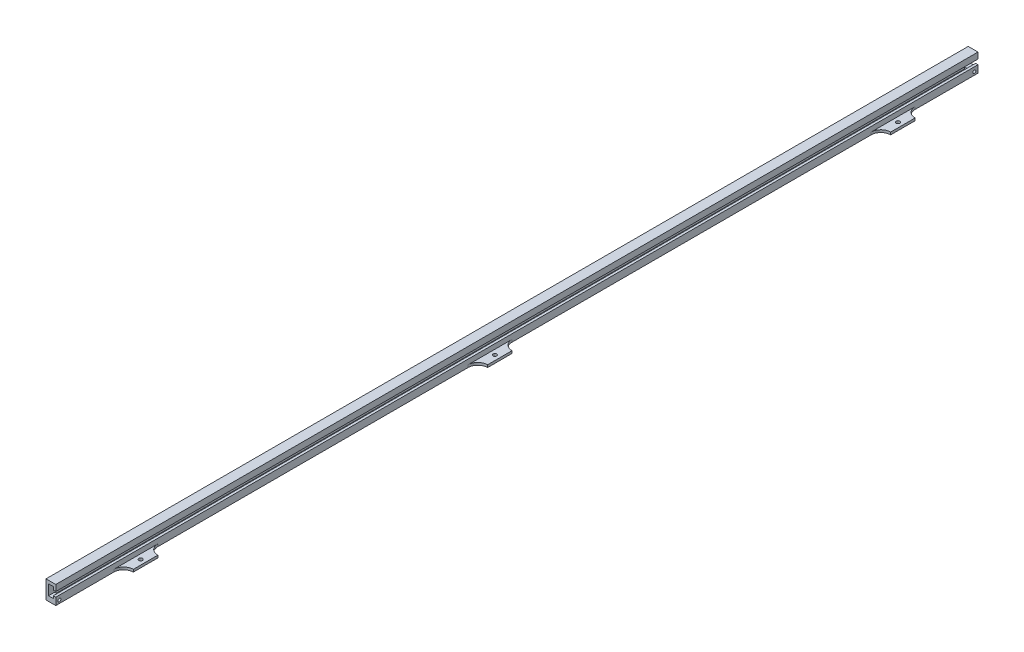
ISO-10303-21;
HEADER;
FILE_DESCRIPTION(('STEP AP214'),'2;1');
FILE_NAME('part.step','',(''),(''),'','','');
FILE_SCHEMA(('AUTOMOTIVE_DESIGN { 1 0 10303 214 1 1 1 1 }'));
ENDSEC;
DATA;
#1=APPLICATION_CONTEXT('core data for automotive mechanical design processes');
#2=APPLICATION_PROTOCOL_DEFINITION('international standard','automotive_design',2000,#1);
#3=PRODUCT_CONTEXT('',#1,'mechanical');
#4=PRODUCT('Part','Part','',(#3));
#5=PRODUCT_RELATED_PRODUCT_CATEGORY('part','',(#4));
#6=PRODUCT_DEFINITION_FORMATION('','',#4);
#7=PRODUCT_DEFINITION_CONTEXT('part definition',#1,'design');
#8=PRODUCT_DEFINITION('design','',#6,#7);
#9=PRODUCT_DEFINITION_SHAPE('','',#8);
#10=(LENGTH_UNIT() NAMED_UNIT(*) SI_UNIT(.MILLI.,.METRE.));
#11=(NAMED_UNIT(*) PLANE_ANGLE_UNIT() SI_UNIT($,.RADIAN.));
#12=(NAMED_UNIT(*) SI_UNIT($,.STERADIAN.) SOLID_ANGLE_UNIT());
#13=UNCERTAINTY_MEASURE_WITH_UNIT(LENGTH_MEASURE(1.E-05),#10,'distance_accuracy_value','');
#14=(GEOMETRIC_REPRESENTATION_CONTEXT(3) GLOBAL_UNCERTAINTY_ASSIGNED_CONTEXT((#13)) GLOBAL_UNIT_ASSIGNED_CONTEXT((#10,
#11,#12)) REPRESENTATION_CONTEXT('',''));
#15=CARTESIAN_POINT('',(0.,0.,0.));
#16=DIRECTION('',(0.,0.,1.));
#17=DIRECTION('',(1.,0.,0.));
#18=AXIS2_PLACEMENT_3D('',#15,#16,#17);
#19=CARTESIAN_POINT('',(8.29532043965097,2.24043168257957,755.));
#20=DIRECTION('',(-1.,0.,0.));
#21=DIRECTION('',(0.,0.,1.));
#22=AXIS2_PLACEMENT_3D('',#19,#20,#21);
#23=PLANE('',#22);
#24=CARTESIAN_POINT('',(8.29532043965097,4.74043168257957,752.));
#25=DIRECTION('',(1.,0.,0.));
#26=DIRECTION('',(0.,0.,-1.));
#27=AXIS2_PLACEMENT_3D('',#24,#25,#26);
#28=CIRCLE('',#27,1.24999999999999);
#29=CARTESIAN_POINT('',(8.29532043965097,4.74043168257957,750.75));
#30=VERTEX_POINT('',#29);
#31=EDGE_CURVE('E533',#30,#30,#28,.T.);
#32=ORIENTED_EDGE('',*,*,#31,.F.);
#33=EDGE_LOOP('',(#32));
#34=FACE_BOUND('',#33,.T.);
#35=DIRECTION('',(0.,0.,-1.));
#36=VECTOR('',#35,1.);
#37=CARTESIAN_POINT('',(8.29532043965097,2.24043168257957,755.));
#38=LINE('',#37,#36);
#39=CARTESIAN_POINT('',(8.29532043965097,2.24043168257957,381.500000045339));
#40=VERTEX_POINT('',#39);
#41=CARTESIAN_POINT('',(8.29532043965097,2.24043168257957,87.5000000453386));
#42=VERTEX_POINT('',#41);
#43=EDGE_CURVE('E464',#40,#42,#38,.T.);
#44=ORIENTED_EDGE('',*,*,#43,.T.);
#45=DIRECTION('',(0.,-1.,0.));
#46=VECTOR('',#45,1.);
#47=CARTESIAN_POINT('',(8.29532043965097,2.24043168257957,87.5000000453386));
#48=LINE('',#47,#46);
#49=CARTESIAN_POINT('',(8.29532043965102,4.24043168257956,87.5000000453386));
#50=VERTEX_POINT('',#49);
#51=EDGE_CURVE('E413',#42,#50,#48,.F.);
#52=ORIENTED_EDGE('',*,*,#51,.T.);
#53=DIRECTION('',(0.,0.,-1.));
#54=VECTOR('',#53,1.);
#55=CARTESIAN_POINT('',(8.29532043965102,4.24043168257956,59.5000000453383));
#56=LINE('',#55,#54);
#57=CARTESIAN_POINT('',(8.29532043965102,4.24043168257956,51.5000000453384));
#58=VERTEX_POINT('',#57);
#59=EDGE_CURVE('E281',#50,#58,#56,.T.);
#60=ORIENTED_EDGE('',*,*,#59,.T.);
#61=DIRECTION('',(0.,-1.,0.));
#62=VECTOR('',#61,1.);
#63=CARTESIAN_POINT('',(8.29532043965097,2.24043168257957,51.5000000453384));
#64=LINE('',#63,#62);
#65=CARTESIAN_POINT('',(8.29532043965097,2.24043168257957,51.5000000453384));
#66=VERTEX_POINT('',#65);
#67=EDGE_CURVE('E410',#58,#66,#64,.T.);
#68=ORIENTED_EDGE('',*,*,#67,.T.);
#69=CARTESIAN_POINT('',(8.29532043965097,2.24043168257957,0.));
#70=VERTEX_POINT('',#69);
#71=EDGE_CURVE('E390',#66,#70,#38,.T.);
#72=ORIENTED_EDGE('',*,*,#71,.T.);
#73=DIRECTION('',(0.,1.,0.));
#74=VECTOR('',#73,1.);
#75=CARTESIAN_POINT('',(8.29532043965097,2.24043168257957,0.));
#76=LINE('',#75,#74);
#77=CARTESIAN_POINT('',(8.29532043965097,8.24043168257957,0.));
#78=VERTEX_POINT('',#77);
#79=EDGE_CURVE('E345',#70,#78,#76,.T.);
#80=ORIENTED_EDGE('',*,*,#79,.T.);
#81=DIRECTION('',(0.,0.,-1.));
#82=VECTOR('',#81,1.);
#83=CARTESIAN_POINT('',(8.29532043965097,8.24043168257957,755.));
#84=LINE('',#83,#82);
#85=CARTESIAN_POINT('',(8.29532043965097,8.24043168257957,755.));
#86=VERTEX_POINT('',#85);
#87=EDGE_CURVE('E387',#86,#78,#84,.T.);
#88=ORIENTED_EDGE('',*,*,#87,.F.);
#89=DIRECTION('',(0.,1.,0.));
#90=VECTOR('',#89,1.);
#91=CARTESIAN_POINT('',(8.29532043965097,2.24043168257957,755.));
#92=LINE('',#91,#90);
#93=CARTESIAN_POINT('',(8.29532043965097,2.24043168257957,755.));
#94=VERTEX_POINT('',#93);
#95=EDGE_CURVE('E321',#94,#86,#92,.T.);
#96=ORIENTED_EDGE('',*,*,#95,.F.);
#97=CARTESIAN_POINT('',(8.29532043965097,2.24043168257957,707.500000045338));
#98=VERTEX_POINT('',#97);
#99=EDGE_CURVE('E391',#94,#98,#38,.T.);
#100=ORIENTED_EDGE('',*,*,#99,.T.);
#101=DIRECTION('',(0.,-1.,0.));
#102=VECTOR('',#101,1.);
#103=CARTESIAN_POINT('',(8.29532043965097,2.24043168257957,707.500000045338));
#104=LINE('',#103,#102);
#105=CARTESIAN_POINT('',(8.29532043965097,4.24043168257956,707.500000045338));
#106=VERTEX_POINT('',#105);
#107=EDGE_CURVE('E398',#98,#106,#104,.F.);
#108=ORIENTED_EDGE('',*,*,#107,.T.);
#109=DIRECTION('',(0.,0.,-1.));
#110=VECTOR('',#109,1.);
#111=CARTESIAN_POINT('',(8.29532043965097,4.24043168257956,679.500000045338));
#112=LINE('',#111,#110);
#113=CARTESIAN_POINT('',(8.29532043965097,4.24043168257956,671.500000045338));
#114=VERTEX_POINT('',#113);
#115=EDGE_CURVE('E261',#106,#114,#112,.T.);
#116=ORIENTED_EDGE('',*,*,#115,.T.);
#117=DIRECTION('',(0.,-1.,0.));
#118=VECTOR('',#117,1.);
#119=CARTESIAN_POINT('',(8.29532043965097,2.24043168257957,671.500000045338));
#120=LINE('',#119,#118);
#121=CARTESIAN_POINT('',(8.29532043965097,2.24043168257957,671.500000045338));
#122=VERTEX_POINT('',#121);
#123=EDGE_CURVE('E401',#114,#122,#120,.T.);
#124=ORIENTED_EDGE('',*,*,#123,.T.);
#125=CARTESIAN_POINT('',(8.29532043965097,2.24043168257957,417.500000045339));
#126=VERTEX_POINT('',#125);
#127=EDGE_CURVE('E395',#122,#126,#38,.T.);
#128=ORIENTED_EDGE('',*,*,#127,.T.);
#129=DIRECTION('',(0.,-1.,0.));
#130=VECTOR('',#129,1.);
#131=CARTESIAN_POINT('',(8.29532043965097,2.24043168257957,417.500000045339));
#132=LINE('',#131,#130);
#133=CARTESIAN_POINT('',(8.29532043965097,4.24043168257956,417.500000045339));
#134=VERTEX_POINT('',#133);
#135=EDGE_CURVE('E404',#126,#134,#132,.F.);
#136=ORIENTED_EDGE('',*,*,#135,.T.);
#137=DIRECTION('',(0.,0.,-1.));
#138=VECTOR('',#137,1.);
#139=CARTESIAN_POINT('',(8.29532043965097,4.24043168257956,389.500000045339));
#140=LINE('',#139,#138);
#141=CARTESIAN_POINT('',(8.29532043965097,4.24043168257956,381.500000045339));
#142=VERTEX_POINT('',#141);
#143=EDGE_CURVE('E301',#134,#142,#140,.T.);
#144=ORIENTED_EDGE('',*,*,#143,.T.);
#145=DIRECTION('',(0.,-1.,0.));
#146=VECTOR('',#145,1.);
#147=CARTESIAN_POINT('',(8.29532043965097,2.24043168257957,381.500000045339));
#148=LINE('',#147,#146);
#149=EDGE_CURVE('E407',#142,#40,#148,.T.);
#150=ORIENTED_EDGE('',*,*,#149,.T.);
#151=EDGE_LOOP('',(#44,#52,#60,#68,#72,#80,#88,#96,#100,#108,#116,#124,#128,#136,#144,#150));
#152=FACE_BOUND('',#151,.T.);
#153=CARTESIAN_POINT('',(8.29532043965097,4.74043168257957,3.));
#154=DIRECTION('',(1.,0.,0.));
#155=DIRECTION('',(0.,0.,-1.));
#156=AXIS2_PLACEMENT_3D('',#153,#154,#155);
#157=CIRCLE('',#156,1.24999999999999);
#158=CARTESIAN_POINT('',(8.29532043965097,4.74043168257957,1.75000000000002));
#159=VERTEX_POINT('',#158);
#160=EDGE_CURVE('E526',#159,#159,#157,.T.);
#161=ORIENTED_EDGE('',*,*,#160,.F.);
#162=EDGE_LOOP('',(#161));
#163=FACE_BOUND('',#162,.T.);
#164=ADVANCED_FACE('F39',(#34,#152,#163),#23,.F.);
#165=CARTESIAN_POINT('',(6.29532043965097,4.74043168257957,755.));
#166=DIRECTION('',(0.,-1.,0.));
#167=DIRECTION('',(1.,0.,0.));
#168=AXIS2_PLACEMENT_3D('',#165,#166,#167);
#169=PLANE('',#168);
#170=DIRECTION('',(-1.,0.,0.));
#171=VECTOR('',#170,1.);
#172=CARTESIAN_POINT('',(0.,4.74043168257956,5.));
#173=LINE('',#172,#171);
#174=CARTESIAN_POINT('',(6.29532043965097,4.74043168257957,5.));
#175=VERTEX_POINT('',#174);
#176=CARTESIAN_POINT('',(2.29532043965097,4.74043168257957,5.));
#177=VERTEX_POINT('',#176);
#178=EDGE_CURVE('E523',#175,#177,#173,.T.);
#179=ORIENTED_EDGE('',*,*,#178,.T.);
#180=DIRECTION('',(0.,0.,-1.));
#181=VECTOR('',#180,1.);
#182=CARTESIAN_POINT('',(2.29532043965097,4.74043168257957,755.));
#183=LINE('',#182,#181);
#184=CARTESIAN_POINT('',(2.29532043965097,4.74043168257957,750.));
#185=VERTEX_POINT('',#184);
#186=EDGE_CURVE('E380',#185,#177,#183,.T.);
#187=ORIENTED_EDGE('',*,*,#186,.F.);
#188=DIRECTION('',(-1.,0.,0.));
#189=VECTOR('',#188,1.);
#190=CARTESIAN_POINT('',(0.,4.74043168257956,750.));
#191=LINE('',#190,#189);
#192=CARTESIAN_POINT('',(6.29532043965097,4.74043168257957,750.));
#193=VERTEX_POINT('',#192);
#194=EDGE_CURVE('E234',#193,#185,#191,.T.);
#195=ORIENTED_EDGE('',*,*,#194,.F.);
#196=DIRECTION('',(0.,0.,-1.));
#197=VECTOR('',#196,1.);
#198=CARTESIAN_POINT('',(6.29532043965097,4.74043168257957,755.));
#199=LINE('',#198,#197);
#200=EDGE_CURVE('E244',#193,#175,#199,.T.);
#201=ORIENTED_EDGE('',*,*,#200,.T.);
#202=EDGE_LOOP('',(#179,#187,#195,#201));
#203=FACE_BOUND('',#202,.T.);
#204=ADVANCED_FACE('F552',(#203),#169,.F.);
#205=CARTESIAN_POINT('',(6.29532043965097,8.24043168257957,755.));
#206=DIRECTION('',(1.,0.,0.));
#207=DIRECTION('',(0.,0.,-1.));
#208=AXIS2_PLACEMENT_3D('',#205,#206,#207);
#209=PLANE('',#208);
#210=DIRECTION('',(0.,0.,-1.));
#211=VECTOR('',#210,1.);
#212=CARTESIAN_POINT('',(6.29532043965097,6.24043168257957,5.));
#213=LINE('',#212,#211);
#214=CARTESIAN_POINT('',(6.29532043965097,6.24043168257957,5.));
#215=VERTEX_POINT('',#214);
#216=CARTESIAN_POINT('',(6.29532043965097,6.24043168257957,0.));
#217=VERTEX_POINT('',#216);
#218=EDGE_CURVE('E54',#215,#217,#213,.T.);
#219=ORIENTED_EDGE('',*,*,#218,.F.);
#220=DIRECTION('',(0.,-1.,0.));
#221=VECTOR('',#220,1.);
#222=CARTESIAN_POINT('',(6.29532043965097,0.,5.));
#223=LINE('',#222,#221);
#224=EDGE_CURVE('E59',#215,#175,#223,.T.);
#225=ORIENTED_EDGE('',*,*,#224,.T.);
#226=ORIENTED_EDGE('',*,*,#200,.F.);
#227=DIRECTION('',(0.,-1.,0.));
#228=VECTOR('',#227,1.);
#229=CARTESIAN_POINT('',(6.29532043965097,0.,750.));
#230=LINE('',#229,#228);
#231=CARTESIAN_POINT('',(6.29532043965097,6.24043168257957,750.));
#232=VERTEX_POINT('',#231);
#233=EDGE_CURVE('E238',#232,#193,#230,.T.);
#234=ORIENTED_EDGE('',*,*,#233,.F.);
#235=DIRECTION('',(0.,0.,1.));
#236=VECTOR('',#235,1.);
#237=CARTESIAN_POINT('',(6.29532043965097,6.24043168257957,750.));
#238=LINE('',#237,#236);
#239=CARTESIAN_POINT('',(6.29532043965097,6.24043168257957,755.));
#240=VERTEX_POINT('',#239);
#241=EDGE_CURVE('E223',#232,#240,#238,.T.);
#242=ORIENTED_EDGE('',*,*,#241,.T.);
#243=DIRECTION('',(0.,-1.,0.));
#244=VECTOR('',#243,1.);
#245=CARTESIAN_POINT('',(6.29532043965097,8.24043168257957,755.));
#246=LINE('',#245,#244);
#247=CARTESIAN_POINT('',(6.29532043965097,8.24043168257957,755.));
#248=VERTEX_POINT('',#247);
#249=EDGE_CURVE('E325',#248,#240,#246,.T.);
#250=ORIENTED_EDGE('',*,*,#249,.F.);
#251=DIRECTION('',(0.,0.,-1.));
#252=VECTOR('',#251,1.);
#253=CARTESIAN_POINT('',(6.29532043965097,8.24043168257957,755.));
#254=LINE('',#253,#252);
#255=CARTESIAN_POINT('',(6.29532043965097,8.24043168257957,0.));
#256=VERTEX_POINT('',#255);
#257=EDGE_CURVE('E384',#248,#256,#254,.T.);
#258=ORIENTED_EDGE('',*,*,#257,.T.);
#259=DIRECTION('',(0.,-1.,0.));
#260=VECTOR('',#259,1.);
#261=CARTESIAN_POINT('',(6.29532043965097,8.24043168257957,0.));
#262=LINE('',#261,#260);
#263=EDGE_CURVE('E349',#256,#217,#262,.T.);
#264=ORIENTED_EDGE('',*,*,#263,.T.);
#265=EDGE_LOOP('',(#219,#225,#226,#234,#242,#250,#258,#264));
#266=FACE_BOUND('',#265,.T.);
#267=ADVANCED_FACE('F243',(#266),#209,.F.);
#268=CARTESIAN_POINT('',(2.29532043965097,14.7404316825796,755.));
#269=DIRECTION('',(-1.,0.,0.));
#270=DIRECTION('',(0.,0.,1.));
#271=AXIS2_PLACEMENT_3D('',#268,#269,#270);
#272=PLANE('',#271);
#273=DIRECTION('',(0.,0.,-1.));
#274=VECTOR('',#273,1.);
#275=CARTESIAN_POINT('',(2.29532043965097,6.24043168257957,5.));
#276=LINE('',#275,#274);
#277=CARTESIAN_POINT('',(2.29532043965097,6.24043168257957,5.));
#278=VERTEX_POINT('',#277);
#279=CARTESIAN_POINT('',(2.29532043965097,6.24043168257957,0.));
#280=VERTEX_POINT('',#279);
#281=EDGE_CURVE('E516',#278,#280,#276,.T.);
#282=ORIENTED_EDGE('',*,*,#281,.T.);
#283=DIRECTION('',(0.,1.,0.));
#284=VECTOR('',#283,1.);
#285=CARTESIAN_POINT('',(2.29532043965097,14.7404316825796,0.));
#286=LINE('',#285,#284);
#287=CARTESIAN_POINT('',(2.29532043965097,14.7404316825796,0.));
#288=VERTEX_POINT('',#287);
#289=EDGE_CURVE('E351',#280,#288,#286,.T.);
#290=ORIENTED_EDGE('',*,*,#289,.T.);
#291=DIRECTION('',(0.,0.,-1.));
#292=VECTOR('',#291,1.);
#293=CARTESIAN_POINT('',(2.29532043965097,14.7404316825796,755.));
#294=LINE('',#293,#292);
#295=CARTESIAN_POINT('',(2.29532043965097,14.7404316825796,755.));
#296=VERTEX_POINT('',#295);
#297=EDGE_CURVE('E377',#296,#288,#294,.T.);
#298=ORIENTED_EDGE('',*,*,#297,.F.);
#299=DIRECTION('',(0.,1.,0.));
#300=VECTOR('',#299,1.);
#301=CARTESIAN_POINT('',(2.29532043965097,14.7404316825796,755.));
#302=LINE('',#301,#300);
#303=CARTESIAN_POINT('',(2.29532043965097,6.24043168257957,755.));
#304=VERTEX_POINT('',#303);
#305=EDGE_CURVE('E327',#304,#296,#302,.T.);
#306=ORIENTED_EDGE('',*,*,#305,.F.);
#307=DIRECTION('',(0.,0.,1.));
#308=VECTOR('',#307,1.);
#309=CARTESIAN_POINT('',(2.29532043965097,6.24043168257957,750.));
#310=LINE('',#309,#308);
#311=CARTESIAN_POINT('',(2.29532043965097,6.24043168257957,750.));
#312=VERTEX_POINT('',#311);
#313=EDGE_CURVE('E233',#312,#304,#310,.T.);
#314=ORIENTED_EDGE('',*,*,#313,.F.);
#315=DIRECTION('',(0.,1.,0.));
#316=VECTOR('',#315,1.);
#317=CARTESIAN_POINT('',(2.29532043965097,0.,750.));
#318=LINE('',#317,#316);
#319=EDGE_CURVE('E241',#185,#312,#318,.T.);
#320=ORIENTED_EDGE('',*,*,#319,.F.);
#321=ORIENTED_EDGE('',*,*,#186,.T.);
#322=DIRECTION('',(0.,1.,0.));
#323=VECTOR('',#322,1.);
#324=CARTESIAN_POINT('',(2.29532043965097,0.,5.));
#325=LINE('',#324,#323);
#326=EDGE_CURVE('E827',#177,#278,#325,.T.);
#327=ORIENTED_EDGE('',*,*,#326,.T.);
#328=EDGE_LOOP('',(#282,#290,#298,#306,#314,#320,#321,#327));
#329=FACE_BOUND('',#328,.T.);
#330=ADVANCED_FACE('F514',(#329),#272,.F.);
#331=CARTESIAN_POINT('',(0.295320439650968,2.24043168257957,755.));
#332=DIRECTION('',(1.,0.,0.));
#333=DIRECTION('',(0.,0.,-1.));
#334=AXIS2_PLACEMENT_3D('',#331,#332,#333);
#335=PLANE('',#334);
#336=CARTESIAN_POINT('',(0.295320439650961,4.74043168257957,3.));
#337=DIRECTION('',(1.,0.,0.));
#338=DIRECTION('',(0.,0.,-1.));
#339=AXIS2_PLACEMENT_3D('',#336,#337,#338);
#340=CIRCLE('',#339,1.24999999999999);
#341=CARTESIAN_POINT('',(0.295320439650961,4.74043168257957,1.75000000000002));
#342=VERTEX_POINT('',#341);
#343=EDGE_CURVE('E521',#342,#342,#340,.T.);
#344=ORIENTED_EDGE('',*,*,#343,.T.);
#345=EDGE_LOOP('',(#344));
#346=FACE_BOUND('',#345,.T.);
#347=CARTESIAN_POINT('',(0.295320439650961,4.74043168257957,752.));
#348=DIRECTION('',(1.,0.,0.));
#349=DIRECTION('',(0.,0.,-1.));
#350=AXIS2_PLACEMENT_3D('',#347,#348,#349);
#351=CIRCLE('',#350,1.24999999999999);
#352=CARTESIAN_POINT('',(0.295320439650961,4.74043168257957,750.75));
#353=VERTEX_POINT('',#352);
#354=EDGE_CURVE('E246',#353,#353,#351,.T.);
#355=ORIENTED_EDGE('',*,*,#354,.T.);
#356=EDGE_LOOP('',(#355));
#357=FACE_BOUND('',#356,.T.);
#358=DIRECTION('',(0.,-1.,0.));
#359=VECTOR('',#358,1.);
#360=CARTESIAN_POINT('',(0.295320439650968,2.24043168257957,0.));
#361=LINE('',#360,#359);
#362=CARTESIAN_POINT('',(0.295320439650968,17.2404316825796,0.));
#363=VERTEX_POINT('',#362);
#364=CARTESIAN_POINT('',(0.295320439650968,2.24043168257957,0.));
#365=VERTEX_POINT('',#364);
#366=EDGE_CURVE('E312',#363,#365,#361,.T.);
#367=ORIENTED_EDGE('',*,*,#366,.T.);
#368=DIRECTION('',(0.,0.,-1.));
#369=VECTOR('',#368,1.);
#370=CARTESIAN_POINT('',(0.295320439650968,2.24043168257957,755.));
#371=LINE('',#370,#369);
#372=CARTESIAN_POINT('',(0.295320439650968,2.24043168257957,755.));
#373=VERTEX_POINT('',#372);
#374=EDGE_CURVE('E394',#373,#365,#371,.T.);
#375=ORIENTED_EDGE('',*,*,#374,.F.);
#376=DIRECTION('',(0.,-1.,0.));
#377=VECTOR('',#376,1.);
#378=CARTESIAN_POINT('',(0.295320439650968,2.24043168257957,755.));
#379=LINE('',#378,#377);
#380=CARTESIAN_POINT('',(0.295320439650968,17.2404316825796,755.));
#381=VERTEX_POINT('',#380);
#382=EDGE_CURVE('E315',#381,#373,#379,.T.);
#383=ORIENTED_EDGE('',*,*,#382,.F.);
#384=DIRECTION('',(0.,0.,-1.));
#385=VECTOR('',#384,1.);
#386=CARTESIAN_POINT('',(0.295320439650968,17.2404316825796,755.));
#387=LINE('',#386,#385);
#388=EDGE_CURVE('E339',#381,#363,#387,.T.);
#389=ORIENTED_EDGE('',*,*,#388,.T.);
#390=EDGE_LOOP('',(#367,#375,#383,#389));
#391=FACE_BOUND('',#390,.T.);
#392=ADVANCED_FACE('F488',(#346,#357,#391),#335,.F.);
#393=CARTESIAN_POINT('',(0.295320439650968,2.24043168257957,755.));
#394=DIRECTION('',(0.,1.,0.));
#395=DIRECTION('',(0.,0.,1.));
#396=AXIS2_PLACEMENT_3D('',#393,#394,#395);
#397=PLANE('',#396);
#398=DIRECTION('',(1.,0.,0.));
#399=VECTOR('',#398,1.);
#400=CARTESIAN_POINT('',(0.295320439650968,2.24043168257957,0.));
#401=LINE('',#400,#399);
#402=EDGE_CURVE('E342',#365,#70,#401,.T.);
#403=ORIENTED_EDGE('',*,*,#402,.T.);
#404=ORIENTED_EDGE('',*,*,#71,.F.);
#405=CARTESIAN_POINT('',(16.295320439651,2.24043168257957,51.5000000453384));
#406=DIRECTION('',(0.,1.,0.));
#407=DIRECTION('',(0.,0.,1.));
#408=AXIS2_PLACEMENT_3D('',#405,#406,#407);
#409=CIRCLE('',#408,8.);
#410=CARTESIAN_POINT('',(16.295320439651,2.24043168257957,59.5000000453383));
#411=VERTEX_POINT('',#410);
#412=EDGE_CURVE('E420',#66,#411,#409,.T.);
#413=ORIENTED_EDGE('',*,*,#412,.T.);
#414=DIRECTION('',(0.,0.,1.));
#415=VECTOR('',#414,1.);
#416=CARTESIAN_POINT('',(16.295320439651,2.24043168257957,79.5000000453386));
#417=LINE('',#416,#415);
#418=CARTESIAN_POINT('',(16.295320439651,2.24043168257957,79.5000000453386));
#419=VERTEX_POINT('',#418);
#420=EDGE_CURVE('E278',#411,#419,#417,.T.);
#421=ORIENTED_EDGE('',*,*,#420,.T.);
#422=CARTESIAN_POINT('',(16.295320439651,2.24043168257957,87.5000000453386));
#423=DIRECTION('',(0.,1.,0.));
#424=DIRECTION('',(0.,0.,1.));
#425=AXIS2_PLACEMENT_3D('',#422,#423,#424);
#426=CIRCLE('',#425,8.);
#427=EDGE_CURVE('E416',#419,#42,#426,.T.);
#428=ORIENTED_EDGE('',*,*,#427,.T.);
#429=ORIENTED_EDGE('',*,*,#43,.F.);
#430=CARTESIAN_POINT('',(16.295320439651,2.24043168257957,381.500000045339));
#431=DIRECTION('',(0.,1.,0.));
#432=DIRECTION('',(0.,0.,1.));
#433=AXIS2_PLACEMENT_3D('',#430,#431,#432);
#434=CIRCLE('',#433,8.);
#435=CARTESIAN_POINT('',(16.295320439651,2.24043168257957,389.500000045339));
#436=VERTEX_POINT('',#435);
#437=EDGE_CURVE('E425',#40,#436,#434,.T.);
#438=ORIENTED_EDGE('',*,*,#437,.T.);
#439=DIRECTION('',(0.,0.,1.));
#440=VECTOR('',#439,1.);
#441=CARTESIAN_POINT('',(16.295320439651,2.24043168257957,409.500000045339));
#442=LINE('',#441,#440);
#443=CARTESIAN_POINT('',(16.295320439651,2.24043168257957,409.500000045339));
#444=VERTEX_POINT('',#443);
#445=EDGE_CURVE('E298',#436,#444,#442,.T.);
#446=ORIENTED_EDGE('',*,*,#445,.T.);
#447=CARTESIAN_POINT('',(16.295320439651,2.24043168257957,417.500000045339));
#448=DIRECTION('',(0.,1.,0.));
#449=DIRECTION('',(0.,0.,1.));
#450=AXIS2_PLACEMENT_3D('',#447,#448,#449);
#451=CIRCLE('',#450,8.);
#452=EDGE_CURVE('E430',#444,#126,#451,.T.);
#453=ORIENTED_EDGE('',*,*,#452,.T.);
#454=ORIENTED_EDGE('',*,*,#127,.F.);
#455=CARTESIAN_POINT('',(16.295320439651,2.24043168257957,671.500000045338));
#456=DIRECTION('',(0.,1.,0.));
#457=DIRECTION('',(0.,0.,1.));
#458=AXIS2_PLACEMENT_3D('',#455,#456,#457);
#459=CIRCLE('',#458,8.);
#460=CARTESIAN_POINT('',(16.295320439651,2.24043168257957,679.500000045338));
#461=VERTEX_POINT('',#460);
#462=EDGE_CURVE('E434',#122,#461,#459,.T.);
#463=ORIENTED_EDGE('',*,*,#462,.T.);
#464=DIRECTION('',(0.,0.,1.));
#465=VECTOR('',#464,1.);
#466=CARTESIAN_POINT('',(16.295320439651,2.24043168257957,699.500000045338));
#467=LINE('',#466,#465);
#468=CARTESIAN_POINT('',(16.295320439651,2.24043168257957,699.500000045338));
#469=VERTEX_POINT('',#468);
#470=EDGE_CURVE('E258',#461,#469,#467,.T.);
#471=ORIENTED_EDGE('',*,*,#470,.T.);
#472=CARTESIAN_POINT('',(16.295320439651,2.24043168257957,707.500000045338));
#473=DIRECTION('',(0.,1.,0.));
#474=DIRECTION('',(0.,0.,1.));
#475=AXIS2_PLACEMENT_3D('',#472,#473,#474);
#476=CIRCLE('',#475,8.);
#477=EDGE_CURVE('E47',#469,#98,#476,.T.);
#478=ORIENTED_EDGE('',*,*,#477,.T.);
#479=ORIENTED_EDGE('',*,*,#99,.F.);
#480=DIRECTION('',(1.,0.,0.));
#481=VECTOR('',#480,1.);
#482=CARTESIAN_POINT('',(0.295320439650968,2.24043168257957,755.));
#483=LINE('',#482,#481);
#484=EDGE_CURVE('E318',#373,#94,#483,.T.);
#485=ORIENTED_EDGE('',*,*,#484,.F.);
#486=ORIENTED_EDGE('',*,*,#374,.T.);
#487=EDGE_LOOP('',(#403,#404,#413,#421,#428,#429,#438,#446,#453,#454,#463,#471,#478,#479,#485,#486));
#488=FACE_BOUND('',#487,.T.);
#489=CARTESIAN_POINT('',(12.295320439651,2.24043168257957,399.500000045339));
#490=DIRECTION('',(0.,-1.,0.));
#491=DIRECTION('',(0.,0.,-1.));
#492=AXIS2_PLACEMENT_3D('',#489,#490,#491);
#493=CIRCLE('',#492,1.5);
#494=CARTESIAN_POINT('',(12.295320439651,2.24043168257957,398.000000045339));
#495=VERTEX_POINT('',#494);
#496=EDGE_CURVE('E292',#495,#495,#493,.T.);
#497=ORIENTED_EDGE('',*,*,#496,.F.);
#498=EDGE_LOOP('',(#497));
#499=FACE_BOUND('',#498,.T.);
#500=CARTESIAN_POINT('',(12.2953204396511,2.24043168257957,69.5000000453385));
#501=DIRECTION('',(0.,-1.,0.));
#502=DIRECTION('',(0.,0.,-1.));
#503=AXIS2_PLACEMENT_3D('',#500,#501,#502);
#504=CIRCLE('',#503,1.5);
#505=CARTESIAN_POINT('',(12.2953204396511,2.24043168257957,68.0000000453385));
#506=VERTEX_POINT('',#505);
#507=EDGE_CURVE('E272',#506,#506,#504,.T.);
#508=ORIENTED_EDGE('',*,*,#507,.F.);
#509=EDGE_LOOP('',(#508));
#510=FACE_BOUND('',#509,.T.);
#511=CARTESIAN_POINT('',(12.295320439651,2.24043168257957,689.500000045338));
#512=DIRECTION('',(0.,-1.,0.));
#513=DIRECTION('',(0.,0.,-1.));
#514=AXIS2_PLACEMENT_3D('',#511,#512,#513);
#515=CIRCLE('',#514,1.5);
#516=CARTESIAN_POINT('',(12.295320439651,2.24043168257957,688.000000045338));
#517=VERTEX_POINT('',#516);
#518=EDGE_CURVE('E253',#517,#517,#515,.T.);
#519=ORIENTED_EDGE('',*,*,#518,.F.);
#520=EDGE_LOOP('',(#519));
#521=FACE_BOUND('',#520,.T.);
#522=ADVANCED_FACE('F440',(#488,#499,#510,#521),#397,.F.);
#523=CARTESIAN_POINT('',(8.29532043965097,8.24043168257957,755.));
#524=DIRECTION('',(0.,-1.,0.));
#525=DIRECTION('',(0.,0.,-1.));
#526=AXIS2_PLACEMENT_3D('',#523,#524,#525);
#527=PLANE('',#526);
#528=DIRECTION('',(-1.,0.,0.));
#529=VECTOR('',#528,1.);
#530=CARTESIAN_POINT('',(8.29532043965097,8.24043168257957,0.));
#531=LINE('',#530,#529);
#532=EDGE_CURVE('E347',#78,#256,#531,.T.);
#533=ORIENTED_EDGE('',*,*,#532,.T.);
#534=ORIENTED_EDGE('',*,*,#257,.F.);
#535=DIRECTION('',(-1.,0.,0.));
#536=VECTOR('',#535,1.);
#537=CARTESIAN_POINT('',(8.29532043965097,8.24043168257957,755.));
#538=LINE('',#537,#536);
#539=EDGE_CURVE('E323',#86,#248,#538,.T.);
#540=ORIENTED_EDGE('',*,*,#539,.F.);
#541=ORIENTED_EDGE('',*,*,#87,.T.);
#542=EDGE_LOOP('',(#533,#534,#540,#541));
#543=FACE_BOUND('',#542,.T.);
#544=ADVANCED_FACE('F480',(#543),#527,.F.);
#545=CARTESIAN_POINT('',(6.29532043965097,14.7404316825796,755.));
#546=DIRECTION('',(0.,1.,0.));
#547=DIRECTION('',(0.,0.,1.));
#548=AXIS2_PLACEMENT_3D('',#545,#546,#547);
#549=PLANE('',#548);
#550=DIRECTION('',(1.,0.,0.));
#551=VECTOR('',#550,1.);
#552=CARTESIAN_POINT('',(6.29532043965097,14.7404316825796,0.));
#553=LINE('',#552,#551);
#554=CARTESIAN_POINT('',(6.29532043965097,14.7404316825796,0.));
#555=VERTEX_POINT('',#554);
#556=EDGE_CURVE('E353',#288,#555,#553,.T.);
#557=ORIENTED_EDGE('',*,*,#556,.T.);
#558=DIRECTION('',(0.,0.,-1.));
#559=VECTOR('',#558,1.);
#560=CARTESIAN_POINT('',(6.29532043965097,14.7404316825796,755.));
#561=LINE('',#560,#559);
#562=CARTESIAN_POINT('',(6.29532043965097,14.7404316825796,755.));
#563=VERTEX_POINT('',#562);
#564=EDGE_CURVE('E374',#563,#555,#561,.T.);
#565=ORIENTED_EDGE('',*,*,#564,.F.);
#566=DIRECTION('',(1.,0.,0.));
#567=VECTOR('',#566,1.);
#568=CARTESIAN_POINT('',(6.29532043965097,14.7404316825796,755.));
#569=LINE('',#568,#567);
#570=EDGE_CURVE('E329',#296,#563,#569,.T.);
#571=ORIENTED_EDGE('',*,*,#570,.F.);
#572=ORIENTED_EDGE('',*,*,#297,.T.);
#573=EDGE_LOOP('',(#557,#565,#571,#572));
#574=FACE_BOUND('',#573,.T.);
#575=ADVANCED_FACE('F510',(#574),#549,.F.);
#576=CARTESIAN_POINT('',(6.29532043965097,12.2404316825796,755.));
#577=DIRECTION('',(1.,0.,0.));
#578=DIRECTION('',(0.,0.,-1.));
#579=AXIS2_PLACEMENT_3D('',#576,#577,#578);
#580=PLANE('',#579);
#581=DIRECTION('',(0.,-1.,0.));
#582=VECTOR('',#581,1.);
#583=CARTESIAN_POINT('',(6.29532043965097,12.2404316825796,0.));
#584=LINE('',#583,#582);
#585=CARTESIAN_POINT('',(6.29532043965097,12.2404316825796,0.));
#586=VERTEX_POINT('',#585);
#587=EDGE_CURVE('E355',#555,#586,#584,.T.);
#588=ORIENTED_EDGE('',*,*,#587,.T.);
#589=DIRECTION('',(0.,0.,-1.));
#590=VECTOR('',#589,1.);
#591=CARTESIAN_POINT('',(6.29532043965097,12.2404316825796,755.));
#592=LINE('',#591,#590);
#593=CARTESIAN_POINT('',(6.29532043965097,12.2404316825796,755.));
#594=VERTEX_POINT('',#593);
#595=EDGE_CURVE('E371',#594,#586,#592,.T.);
#596=ORIENTED_EDGE('',*,*,#595,.F.);
#597=DIRECTION('',(0.,-1.,0.));
#598=VECTOR('',#597,1.);
#599=CARTESIAN_POINT('',(6.29532043965097,12.2404316825796,755.));
#600=LINE('',#599,#598);
#601=EDGE_CURVE('E331',#563,#594,#600,.T.);
#602=ORIENTED_EDGE('',*,*,#601,.F.);
#603=ORIENTED_EDGE('',*,*,#564,.T.);
#604=EDGE_LOOP('',(#588,#596,#602,#603));
#605=FACE_BOUND('',#604,.T.);
#606=ADVANCED_FACE('F505',(#605),#580,.F.);
#607=CARTESIAN_POINT('',(8.29532043965097,12.2404316825796,755.));
#608=DIRECTION('',(0.,1.,0.));
#609=DIRECTION('',(0.,0.,1.));
#610=AXIS2_PLACEMENT_3D('',#607,#608,#609);
#611=PLANE('',#610);
#612=DIRECTION('',(1.,0.,0.));
#613=VECTOR('',#612,1.);
#614=CARTESIAN_POINT('',(8.29532043965097,12.2404316825796,0.));
#615=LINE('',#614,#613);
#616=CARTESIAN_POINT('',(8.29532043965097,12.2404316825796,0.));
#617=VERTEX_POINT('',#616);
#618=EDGE_CURVE('E357',#586,#617,#615,.T.);
#619=ORIENTED_EDGE('',*,*,#618,.T.);
#620=DIRECTION('',(0.,0.,-1.));
#621=VECTOR('',#620,1.);
#622=CARTESIAN_POINT('',(8.29532043965097,12.2404316825796,755.));
#623=LINE('',#622,#621);
#624=CARTESIAN_POINT('',(8.29532043965097,12.2404316825796,755.));
#625=VERTEX_POINT('',#624);
#626=EDGE_CURVE('E368',#625,#617,#623,.T.);
#627=ORIENTED_EDGE('',*,*,#626,.F.);
#628=DIRECTION('',(1.,0.,0.));
#629=VECTOR('',#628,1.);
#630=CARTESIAN_POINT('',(8.29532043965097,12.2404316825796,755.));
#631=LINE('',#630,#629);
#632=EDGE_CURVE('E333',#594,#625,#631,.T.);
#633=ORIENTED_EDGE('',*,*,#632,.F.);
#634=ORIENTED_EDGE('',*,*,#595,.T.);
#635=EDGE_LOOP('',(#619,#627,#633,#634));
#636=FACE_BOUND('',#635,.T.);
#637=ADVANCED_FACE('F500',(#636),#611,.F.);
#638=CARTESIAN_POINT('',(8.29532043965097,17.2404316825796,755.));
#639=DIRECTION('',(-1.,0.,0.));
#640=DIRECTION('',(0.,0.,1.));
#641=AXIS2_PLACEMENT_3D('',#638,#639,#640);
#642=PLANE('',#641);
#643=DIRECTION('',(0.,1.,0.));
#644=VECTOR('',#643,1.);
#645=CARTESIAN_POINT('',(8.29532043965097,17.2404316825796,0.));
#646=LINE('',#645,#644);
#647=CARTESIAN_POINT('',(8.29532043965097,17.2404316825796,0.));
#648=VERTEX_POINT('',#647);
#649=EDGE_CURVE('E360',#617,#648,#646,.T.);
#650=ORIENTED_EDGE('',*,*,#649,.T.);
#651=DIRECTION('',(0.,0.,-1.));
#652=VECTOR('',#651,1.);
#653=CARTESIAN_POINT('',(8.29532043965097,17.2404316825796,755.));
#654=LINE('',#653,#652);
#655=CARTESIAN_POINT('',(8.29532043965097,17.2404316825796,755.));
#656=VERTEX_POINT('',#655);
#657=EDGE_CURVE('E365',#656,#648,#654,.T.);
#658=ORIENTED_EDGE('',*,*,#657,.F.);
#659=DIRECTION('',(0.,1.,0.));
#660=VECTOR('',#659,1.);
#661=CARTESIAN_POINT('',(8.29532043965097,14.7404316825796,755.));
#662=LINE('',#661,#660);
#663=EDGE_CURVE('E335',#625,#656,#662,.T.);
#664=ORIENTED_EDGE('',*,*,#663,.F.);
#665=ORIENTED_EDGE('',*,*,#626,.T.);
#666=EDGE_LOOP('',(#650,#658,#664,#665));
#667=FACE_BOUND('',#666,.T.);
#668=ADVANCED_FACE('F496',(#667),#642,.F.);
#669=CARTESIAN_POINT('',(0.295320439650968,17.2404316825796,755.));
#670=DIRECTION('',(0.,-1.,0.));
#671=DIRECTION('',(0.,0.,-1.));
#672=AXIS2_PLACEMENT_3D('',#669,#670,#671);
#673=PLANE('',#672);
#674=DIRECTION('',(-1.,0.,0.));
#675=VECTOR('',#674,1.);
#676=CARTESIAN_POINT('',(0.295320439650968,17.2404316825796,0.));
#677=LINE('',#676,#675);
#678=EDGE_CURVE('E319',#648,#363,#677,.T.);
#679=ORIENTED_EDGE('',*,*,#678,.T.);
#680=ORIENTED_EDGE('',*,*,#388,.F.);
#681=DIRECTION('',(-1.,0.,0.));
#682=VECTOR('',#681,1.);
#683=CARTESIAN_POINT('',(0.295320439650968,17.2404316825796,755.));
#684=LINE('',#683,#682);
#685=EDGE_CURVE('E337',#656,#381,#684,.T.);
#686=ORIENTED_EDGE('',*,*,#685,.F.);
#687=ORIENTED_EDGE('',*,*,#657,.T.);
#688=EDGE_LOOP('',(#679,#680,#686,#687));
#689=FACE_BOUND('',#688,.T.);
#690=ADVANCED_FACE('F492',(#689),#673,.F.);
#691=CARTESIAN_POINT('',(0.,0.,755.));
#692=DIRECTION('',(0.,0.,-1.));
#693=DIRECTION('',(-1.,0.,0.));
#694=AXIS2_PLACEMENT_3D('',#691,#692,#693);
#695=PLANE('',#694);
#696=ORIENTED_EDGE('',*,*,#382,.T.);
#697=ORIENTED_EDGE('',*,*,#484,.T.);
#698=ORIENTED_EDGE('',*,*,#95,.T.);
#699=ORIENTED_EDGE('',*,*,#539,.T.);
#700=ORIENTED_EDGE('',*,*,#249,.T.);
#701=DIRECTION('',(-1.,0.,0.));
#702=VECTOR('',#701,1.);
#703=CARTESIAN_POINT('',(0.,6.24043168257957,755.));
#704=LINE('',#703,#702);
#705=EDGE_CURVE('E229',#240,#304,#704,.T.);
#706=ORIENTED_EDGE('',*,*,#705,.T.);
#707=ORIENTED_EDGE('',*,*,#305,.T.);
#708=ORIENTED_EDGE('',*,*,#570,.T.);
#709=ORIENTED_EDGE('',*,*,#601,.T.);
#710=ORIENTED_EDGE('',*,*,#632,.T.);
#711=ORIENTED_EDGE('',*,*,#663,.T.);
#712=ORIENTED_EDGE('',*,*,#685,.T.);
#713=EDGE_LOOP('',(#696,#697,#698,#699,#700,#706,#707,#708,#709,#710,#711,#712));
#714=FACE_BOUND('',#713,.T.);
#715=ADVANCED_FACE('F483',(#714),#695,.F.);
#716=CARTESIAN_POINT('',(0.,0.,0.));
#717=DIRECTION('',(0.,0.,-1.));
#718=DIRECTION('',(-1.,0.,0.));
#719=AXIS2_PLACEMENT_3D('',#716,#717,#718);
#720=PLANE('',#719);
#721=ORIENTED_EDGE('',*,*,#289,.F.);
#722=DIRECTION('',(-1.,0.,0.));
#723=VECTOR('',#722,1.);
#724=CARTESIAN_POINT('',(0.,6.24043168257957,0.));
#725=LINE('',#724,#723);
#726=EDGE_CURVE('E518',#217,#280,#725,.T.);
#727=ORIENTED_EDGE('',*,*,#726,.F.);
#728=ORIENTED_EDGE('',*,*,#263,.F.);
#729=ORIENTED_EDGE('',*,*,#532,.F.);
#730=ORIENTED_EDGE('',*,*,#79,.F.);
#731=ORIENTED_EDGE('',*,*,#402,.F.);
#732=ORIENTED_EDGE('',*,*,#366,.F.);
#733=ORIENTED_EDGE('',*,*,#678,.F.);
#734=ORIENTED_EDGE('',*,*,#649,.F.);
#735=ORIENTED_EDGE('',*,*,#618,.F.);
#736=ORIENTED_EDGE('',*,*,#587,.F.);
#737=ORIENTED_EDGE('',*,*,#556,.F.);
#738=EDGE_LOOP('',(#721,#727,#728,#729,#730,#731,#732,#733,#734,#735,#736,#737));
#739=FACE_BOUND('',#738,.T.);
#740=ADVANCED_FACE('F475',(#739),#720,.T.);
#741=CARTESIAN_POINT('',(16.295320439651,4.24043168257956,409.500000045339));
#742=DIRECTION('',(1.,0.,0.));
#743=DIRECTION('',(0.,0.,-1.));
#744=AXIS2_PLACEMENT_3D('',#741,#742,#743);
#745=PLANE('',#744);
#746=ORIENTED_EDGE('',*,*,#445,.F.);
#747=DIRECTION('',(0.,-1.,0.));
#748=VECTOR('',#747,1.);
#749=CARTESIAN_POINT('',(16.295320439651,4.24043168257956,389.500000045339));
#750=LINE('',#749,#748);
#751=CARTESIAN_POINT('',(16.295320439651,4.24043168257956,389.500000045339));
#752=VERTEX_POINT('',#751);
#753=EDGE_CURVE('E306',#752,#436,#750,.T.);
#754=ORIENTED_EDGE('',*,*,#753,.F.);
#755=DIRECTION('',(0.,0.,1.));
#756=VECTOR('',#755,1.);
#757=CARTESIAN_POINT('',(16.295320439651,4.24043168257956,409.500000045339));
#758=LINE('',#757,#756);
#759=CARTESIAN_POINT('',(16.295320439651,4.24043168257956,409.500000045339));
#760=VERTEX_POINT('',#759);
#761=EDGE_CURVE('E303',#752,#760,#758,.T.);
#762=ORIENTED_EDGE('',*,*,#761,.T.);
#763=DIRECTION('',(0.,-1.,0.));
#764=VECTOR('',#763,1.);
#765=CARTESIAN_POINT('',(16.295320439651,4.24043168257956,409.500000045339));
#766=LINE('',#765,#764);
#767=EDGE_CURVE('E309',#760,#444,#766,.T.);
#768=ORIENTED_EDGE('',*,*,#767,.T.);
#769=EDGE_LOOP('',(#746,#754,#762,#768));
#770=FACE_BOUND('',#769,.T.);
#771=ADVANCED_FACE('F622',(#770),#745,.T.);
#772=CARTESIAN_POINT('',(0.,4.24043168257956,0.));
#773=DIRECTION('',(0.,1.,0.));
#774=DIRECTION('',(0.,0.,1.));
#775=AXIS2_PLACEMENT_3D('',#772,#773,#774);
#776=PLANE('',#775);
#777=CARTESIAN_POINT('',(12.295320439651,4.24043168257956,399.500000045339));
#778=DIRECTION('',(0.,-1.,0.));
#779=DIRECTION('',(0.,0.,-1.));
#780=AXIS2_PLACEMENT_3D('',#777,#778,#779);
#781=CIRCLE('',#780,1.5);
#782=CARTESIAN_POINT('',(12.295320439651,4.24043168257956,398.000000045339));
#783=VERTEX_POINT('',#782);
#784=EDGE_CURVE('E295',#783,#783,#781,.T.);
#785=ORIENTED_EDGE('',*,*,#784,.T.);
#786=EDGE_LOOP('',(#785));
#787=FACE_BOUND('',#786,.T.);
#788=ORIENTED_EDGE('',*,*,#143,.F.);
#789=CARTESIAN_POINT('',(16.295320439651,4.24043168257956,417.500000045339));
#790=DIRECTION('',(0.,1.,0.));
#791=DIRECTION('',(0.,0.,1.));
#792=AXIS2_PLACEMENT_3D('',#789,#790,#791);
#793=CIRCLE('',#792,8.);
#794=EDGE_CURVE('E432',#134,#760,#793,.F.);
#795=ORIENTED_EDGE('',*,*,#794,.T.);
#796=ORIENTED_EDGE('',*,*,#761,.F.);
#797=CARTESIAN_POINT('',(16.295320439651,4.24043168257956,381.500000045339));
#798=DIRECTION('',(0.,1.,0.));
#799=DIRECTION('',(0.,0.,1.));
#800=AXIS2_PLACEMENT_3D('',#797,#798,#799);
#801=CIRCLE('',#800,8.);
#802=EDGE_CURVE('E427',#752,#142,#801,.F.);
#803=ORIENTED_EDGE('',*,*,#802,.T.);
#804=EDGE_LOOP('',(#788,#795,#796,#803));
#805=FACE_BOUND('',#804,.T.);
#806=ADVANCED_FACE('F618',(#787,#805),#776,.T.);
#807=CARTESIAN_POINT('',(12.295320439651,4.24043168257956,399.500000045339));
#808=DIRECTION('',(0.,-1.,0.));
#809=DIRECTION('',(0.,0.,-1.));
#810=AXIS2_PLACEMENT_3D('',#807,#808,#809);
#811=CYLINDRICAL_SURFACE('',#810,1.5);
#812=ORIENTED_EDGE('',*,*,#784,.F.);
#813=EDGE_LOOP('',(#812));
#814=FACE_BOUND('',#813,.T.);
#815=ORIENTED_EDGE('',*,*,#496,.T.);
#816=EDGE_LOOP('',(#815));
#817=FACE_BOUND('',#816,.T.);
#818=ADVANCED_FACE('F614',(#814,#817),#811,.F.);
#819=CARTESIAN_POINT('',(16.295320439651,4.24043168257956,79.5000000453386));
#820=DIRECTION('',(1.,0.,0.));
#821=DIRECTION('',(0.,0.,-1.));
#822=AXIS2_PLACEMENT_3D('',#819,#820,#821);
#823=PLANE('',#822);
#824=ORIENTED_EDGE('',*,*,#420,.F.);
#825=DIRECTION('',(0.,-1.,0.));
#826=VECTOR('',#825,1.);
#827=CARTESIAN_POINT('',(16.295320439651,4.24043168257956,59.5000000453383));
#828=LINE('',#827,#826);
#829=CARTESIAN_POINT('',(16.295320439651,4.24043168257956,59.5000000453383));
#830=VERTEX_POINT('',#829);
#831=EDGE_CURVE('E286',#830,#411,#828,.T.);
#832=ORIENTED_EDGE('',*,*,#831,.F.);
#833=DIRECTION('',(0.,0.,1.));
#834=VECTOR('',#833,1.);
#835=CARTESIAN_POINT('',(16.295320439651,4.24043168257956,79.5000000453386));
#836=LINE('',#835,#834);
#837=CARTESIAN_POINT('',(16.295320439651,4.24043168257956,79.5000000453386));
#838=VERTEX_POINT('',#837);
#839=EDGE_CURVE('E283',#830,#838,#836,.T.);
#840=ORIENTED_EDGE('',*,*,#839,.T.);
#841=DIRECTION('',(0.,-1.,0.));
#842=VECTOR('',#841,1.);
#843=CARTESIAN_POINT('',(16.295320439651,4.24043168257956,79.5000000453386));
#844=LINE('',#843,#842);
#845=EDGE_CURVE('E289',#838,#419,#844,.T.);
#846=ORIENTED_EDGE('',*,*,#845,.T.);
#847=EDGE_LOOP('',(#824,#832,#840,#846));
#848=FACE_BOUND('',#847,.T.);
#849=ADVANCED_FACE('F610',(#848),#823,.T.);
#850=CARTESIAN_POINT('',(0.,4.24043168257956,0.));
#851=DIRECTION('',(0.,1.,0.));
#852=DIRECTION('',(0.,0.,1.));
#853=AXIS2_PLACEMENT_3D('',#850,#851,#852);
#854=PLANE('',#853);
#855=CARTESIAN_POINT('',(12.2953204396511,4.24043168257956,69.5000000453385));
#856=DIRECTION('',(0.,-1.,0.));
#857=DIRECTION('',(0.,0.,-1.));
#858=AXIS2_PLACEMENT_3D('',#855,#856,#857);
#859=CIRCLE('',#858,1.5);
#860=CARTESIAN_POINT('',(12.2953204396511,4.24043168257956,68.0000000453385));
#861=VERTEX_POINT('',#860);
#862=EDGE_CURVE('E275',#861,#861,#859,.T.);
#863=ORIENTED_EDGE('',*,*,#862,.T.);
#864=EDGE_LOOP('',(#863));
#865=FACE_BOUND('',#864,.T.);
#866=ORIENTED_EDGE('',*,*,#59,.F.);
#867=CARTESIAN_POINT('',(16.295320439651,4.24043168257956,87.5000000453386));
#868=DIRECTION('',(0.,1.,0.));
#869=DIRECTION('',(0.,0.,1.));
#870=AXIS2_PLACEMENT_3D('',#867,#868,#869);
#871=CIRCLE('',#870,8.);
#872=EDGE_CURVE('E418',#50,#838,#871,.F.);
#873=ORIENTED_EDGE('',*,*,#872,.T.);
#874=ORIENTED_EDGE('',*,*,#839,.F.);
#875=CARTESIAN_POINT('',(16.295320439651,4.24043168257956,51.5000000453384));
#876=DIRECTION('',(0.,1.,0.));
#877=DIRECTION('',(0.,0.,1.));
#878=AXIS2_PLACEMENT_3D('',#875,#876,#877);
#879=CIRCLE('',#878,8.);
#880=EDGE_CURVE('E422',#830,#58,#879,.F.);
#881=ORIENTED_EDGE('',*,*,#880,.T.);
#882=EDGE_LOOP('',(#866,#873,#874,#881));
#883=FACE_BOUND('',#882,.T.);
#884=ADVANCED_FACE('F606',(#865,#883),#854,.T.);
#885=CARTESIAN_POINT('',(12.2953204396511,4.24043168257956,69.5000000453385));
#886=DIRECTION('',(0.,-1.,0.));
#887=DIRECTION('',(0.,0.,-1.));
#888=AXIS2_PLACEMENT_3D('',#885,#886,#887);
#889=CYLINDRICAL_SURFACE('',#888,1.5);
#890=ORIENTED_EDGE('',*,*,#862,.F.);
#891=EDGE_LOOP('',(#890));
#892=FACE_BOUND('',#891,.T.);
#893=ORIENTED_EDGE('',*,*,#507,.T.);
#894=EDGE_LOOP('',(#893));
#895=FACE_BOUND('',#894,.T.);
#896=ADVANCED_FACE('F603',(#892,#895),#889,.F.);
#897=CARTESIAN_POINT('',(16.295320439651,4.24043168257956,699.500000045338));
#898=DIRECTION('',(1.,0.,0.));
#899=DIRECTION('',(0.,0.,-1.));
#900=AXIS2_PLACEMENT_3D('',#897,#898,#899);
#901=PLANE('',#900);
#902=ORIENTED_EDGE('',*,*,#470,.F.);
#903=DIRECTION('',(0.,-1.,0.));
#904=VECTOR('',#903,1.);
#905=CARTESIAN_POINT('',(16.295320439651,4.24043168257956,679.500000045338));
#906=LINE('',#905,#904);
#907=CARTESIAN_POINT('',(16.295320439651,4.24043168257956,679.500000045338));
#908=VERTEX_POINT('',#907);
#909=EDGE_CURVE('E266',#908,#461,#906,.T.);
#910=ORIENTED_EDGE('',*,*,#909,.F.);
#911=DIRECTION('',(0.,0.,1.));
#912=VECTOR('',#911,1.);
#913=CARTESIAN_POINT('',(16.295320439651,4.24043168257956,699.500000045338));
#914=LINE('',#913,#912);
#915=CARTESIAN_POINT('',(16.295320439651,4.24043168257956,699.500000045338));
#916=VERTEX_POINT('',#915);
#917=EDGE_CURVE('E263',#908,#916,#914,.T.);
#918=ORIENTED_EDGE('',*,*,#917,.T.);
#919=DIRECTION('',(0.,-1.,0.));
#920=VECTOR('',#919,1.);
#921=CARTESIAN_POINT('',(16.295320439651,4.24043168257956,699.500000045338));
#922=LINE('',#921,#920);
#923=EDGE_CURVE('E269',#916,#469,#922,.T.);
#924=ORIENTED_EDGE('',*,*,#923,.T.);
#925=EDGE_LOOP('',(#902,#910,#918,#924));
#926=FACE_BOUND('',#925,.T.);
#927=ADVANCED_FACE('F457',(#926),#901,.T.);
#928=CARTESIAN_POINT('',(0.,4.24043168257956,0.));
#929=DIRECTION('',(0.,1.,0.));
#930=DIRECTION('',(0.,0.,1.));
#931=AXIS2_PLACEMENT_3D('',#928,#929,#930);
#932=PLANE('',#931);
#933=CARTESIAN_POINT('',(12.295320439651,4.24043168257956,689.500000045338));
#934=DIRECTION('',(0.,-1.,0.));
#935=DIRECTION('',(0.,0.,-1.));
#936=AXIS2_PLACEMENT_3D('',#933,#934,#935);
#937=CIRCLE('',#936,1.5);
#938=CARTESIAN_POINT('',(12.295320439651,4.24043168257956,688.000000045338));
#939=VERTEX_POINT('',#938);
#940=EDGE_CURVE('E255',#939,#939,#937,.T.);
#941=ORIENTED_EDGE('',*,*,#940,.T.);
#942=EDGE_LOOP('',(#941));
#943=FACE_BOUND('',#942,.T.);
#944=ORIENTED_EDGE('',*,*,#115,.F.);
#945=CARTESIAN_POINT('',(16.295320439651,4.24043168257956,707.500000045338));
#946=DIRECTION('',(0.,1.,0.));
#947=DIRECTION('',(0.,0.,1.));
#948=AXIS2_PLACEMENT_3D('',#945,#946,#947);
#949=CIRCLE('',#948,8.);
#950=EDGE_CURVE('E11',#106,#916,#949,.F.);
#951=ORIENTED_EDGE('',*,*,#950,.T.);
#952=ORIENTED_EDGE('',*,*,#917,.F.);
#953=CARTESIAN_POINT('',(16.295320439651,4.24043168257956,671.500000045338));
#954=DIRECTION('',(0.,1.,0.));
#955=DIRECTION('',(0.,0.,1.));
#956=AXIS2_PLACEMENT_3D('',#953,#954,#955);
#957=CIRCLE('',#956,8.);
#958=EDGE_CURVE('E436',#908,#114,#957,.F.);
#959=ORIENTED_EDGE('',*,*,#958,.T.);
#960=EDGE_LOOP('',(#944,#951,#952,#959));
#961=FACE_BOUND('',#960,.T.);
#962=ADVANCED_FACE('F454',(#943,#961),#932,.T.);
#963=CARTESIAN_POINT('',(12.295320439651,4.24043168257956,689.500000045338));
#964=DIRECTION('',(0.,-1.,0.));
#965=DIRECTION('',(0.,0.,-1.));
#966=AXIS2_PLACEMENT_3D('',#963,#964,#965);
#967=CYLINDRICAL_SURFACE('',#966,1.5);
#968=ORIENTED_EDGE('',*,*,#940,.F.);
#969=EDGE_LOOP('',(#968));
#970=FACE_BOUND('',#969,.T.);
#971=ORIENTED_EDGE('',*,*,#518,.T.);
#972=EDGE_LOOP('',(#971));
#973=FACE_BOUND('',#972,.T.);
#974=ADVANCED_FACE('F572',(#970,#973),#967,.F.);
#975=CARTESIAN_POINT('',(16.295320439651,4.24043168257956,87.5000000453386));
#976=DIRECTION('',(0.,-1.,0.));
#977=DIRECTION('',(0.,0.,-1.));
#978=AXIS2_PLACEMENT_3D('',#975,#976,#977);
#979=CYLINDRICAL_SURFACE('',#978,8.);
#980=ORIENTED_EDGE('',*,*,#872,.F.);
#981=ORIENTED_EDGE('',*,*,#51,.F.);
#982=ORIENTED_EDGE('',*,*,#427,.F.);
#983=ORIENTED_EDGE('',*,*,#845,.F.);
#984=EDGE_LOOP('',(#980,#981,#982,#983));
#985=FACE_BOUND('',#984,.T.);
#986=ADVANCED_FACE('F568',(#985),#979,.F.);
#987=CARTESIAN_POINT('',(16.295320439651,2.24043168257957,51.5000000453384));
#988=DIRECTION('',(0.,-1.,0.));
#989=DIRECTION('',(0.,0.,-1.));
#990=AXIS2_PLACEMENT_3D('',#987,#988,#989);
#991=CYLINDRICAL_SURFACE('',#990,8.);
#992=ORIENTED_EDGE('',*,*,#880,.F.);
#993=ORIENTED_EDGE('',*,*,#831,.T.);
#994=ORIENTED_EDGE('',*,*,#412,.F.);
#995=ORIENTED_EDGE('',*,*,#67,.F.);
#996=EDGE_LOOP('',(#992,#993,#994,#995));
#997=FACE_BOUND('',#996,.T.);
#998=ADVANCED_FACE('F571',(#997),#991,.F.);
#999=CARTESIAN_POINT('',(16.295320439651,2.24043168257957,381.500000045339));
#1000=DIRECTION('',(0.,-1.,0.));
#1001=DIRECTION('',(0.,0.,-1.));
#1002=AXIS2_PLACEMENT_3D('',#999,#1000,#1001);
#1003=CYLINDRICAL_SURFACE('',#1002,8.);
#1004=ORIENTED_EDGE('',*,*,#802,.F.);
#1005=ORIENTED_EDGE('',*,*,#753,.T.);
#1006=ORIENTED_EDGE('',*,*,#437,.F.);
#1007=ORIENTED_EDGE('',*,*,#149,.F.);
#1008=EDGE_LOOP('',(#1004,#1005,#1006,#1007));
#1009=FACE_BOUND('',#1008,.T.);
#1010=ADVANCED_FACE('F576',(#1009),#1003,.F.);
#1011=CARTESIAN_POINT('',(16.295320439651,4.24043168257956,417.500000045339));
#1012=DIRECTION('',(0.,-1.,0.));
#1013=DIRECTION('',(0.,0.,-1.));
#1014=AXIS2_PLACEMENT_3D('',#1011,#1012,#1013);
#1015=CYLINDRICAL_SURFACE('',#1014,8.);
#1016=ORIENTED_EDGE('',*,*,#794,.F.);
#1017=ORIENTED_EDGE('',*,*,#135,.F.);
#1018=ORIENTED_EDGE('',*,*,#452,.F.);
#1019=ORIENTED_EDGE('',*,*,#767,.F.);
#1020=EDGE_LOOP('',(#1016,#1017,#1018,#1019));
#1021=FACE_BOUND('',#1020,.T.);
#1022=ADVANCED_FACE('F580',(#1021),#1015,.F.);
#1023=CARTESIAN_POINT('',(16.295320439651,2.24043168257957,671.500000045338));
#1024=DIRECTION('',(0.,-1.,0.));
#1025=DIRECTION('',(0.,0.,-1.));
#1026=AXIS2_PLACEMENT_3D('',#1023,#1024,#1025);
#1027=CYLINDRICAL_SURFACE('',#1026,8.);
#1028=ORIENTED_EDGE('',*,*,#958,.F.);
#1029=ORIENTED_EDGE('',*,*,#909,.T.);
#1030=ORIENTED_EDGE('',*,*,#462,.F.);
#1031=ORIENTED_EDGE('',*,*,#123,.F.);
#1032=EDGE_LOOP('',(#1028,#1029,#1030,#1031));
#1033=FACE_BOUND('',#1032,.T.);
#1034=ADVANCED_FACE('F459',(#1033),#1027,.F.);
#1035=CARTESIAN_POINT('',(16.295320439651,4.24043168257956,707.500000045338));
#1036=DIRECTION('',(0.,-1.,0.));
#1037=DIRECTION('',(0.,0.,-1.));
#1038=AXIS2_PLACEMENT_3D('',#1035,#1036,#1037);
#1039=CYLINDRICAL_SURFACE('',#1038,8.);
#1040=ORIENTED_EDGE('',*,*,#950,.F.);
#1041=ORIENTED_EDGE('',*,*,#107,.F.);
#1042=ORIENTED_EDGE('',*,*,#477,.F.);
#1043=ORIENTED_EDGE('',*,*,#923,.F.);
#1044=EDGE_LOOP('',(#1040,#1041,#1042,#1043));
#1045=FACE_BOUND('',#1044,.T.);
#1046=ADVANCED_FACE('F41',(#1045),#1039,.F.);
#1047=CARTESIAN_POINT('',(0.,6.24043168257957,750.));
#1048=DIRECTION('',(0.,1.,0.));
#1049=DIRECTION('',(0.,0.,1.));
#1050=AXIS2_PLACEMENT_3D('',#1047,#1048,#1049);
#1051=PLANE('',#1050);
#1052=ORIENTED_EDGE('',*,*,#705,.F.);
#1053=ORIENTED_EDGE('',*,*,#241,.F.);
#1054=DIRECTION('',(-1.,0.,0.));
#1055=VECTOR('',#1054,1.);
#1056=CARTESIAN_POINT('',(0.,6.24043168257957,750.));
#1057=LINE('',#1056,#1055);
#1058=EDGE_CURVE('E227',#232,#312,#1057,.T.);
#1059=ORIENTED_EDGE('',*,*,#1058,.T.);
#1060=ORIENTED_EDGE('',*,*,#313,.T.);
#1061=EDGE_LOOP('',(#1052,#1053,#1059,#1060));
#1062=FACE_BOUND('',#1061,.T.);
#1063=ADVANCED_FACE('F225',(#1062),#1051,.T.);
#1064=CARTESIAN_POINT('',(0.,0.,750.));
#1065=DIRECTION('',(0.,0.,1.));
#1066=DIRECTION('',(1.,0.,0.));
#1067=AXIS2_PLACEMENT_3D('',#1064,#1065,#1066);
#1068=PLANE('',#1067);
#1069=ORIENTED_EDGE('',*,*,#233,.T.);
#1070=ORIENTED_EDGE('',*,*,#194,.T.);
#1071=ORIENTED_EDGE('',*,*,#319,.T.);
#1072=ORIENTED_EDGE('',*,*,#1058,.F.);
#1073=EDGE_LOOP('',(#1069,#1070,#1071,#1072));
#1074=FACE_BOUND('',#1073,.T.);
#1075=ADVANCED_FACE('F237',(#1074),#1068,.F.);
#1076=CARTESIAN_POINT('',(8.29532043965097,4.74043168257957,752.));
#1077=DIRECTION('',(1.,0.,0.));
#1078=DIRECTION('',(0.,0.,-1.));
#1079=AXIS2_PLACEMENT_3D('',#1076,#1077,#1078);
#1080=CYLINDRICAL_SURFACE('',#1079,1.24999999999999);
#1081=ORIENTED_EDGE('',*,*,#354,.F.);
#1082=EDGE_LOOP('',(#1081));
#1083=FACE_BOUND('',#1082,.T.);
#1084=ORIENTED_EDGE('',*,*,#31,.T.);
#1085=EDGE_LOOP('',(#1084));
#1086=FACE_BOUND('',#1085,.T.);
#1087=ADVANCED_FACE('F541',(#1083,#1086),#1080,.F.);
#1088=CARTESIAN_POINT('',(0.,6.24043168257957,5.));
#1089=DIRECTION('',(0.,-1.,0.));
#1090=DIRECTION('',(0.,0.,-1.));
#1091=AXIS2_PLACEMENT_3D('',#1088,#1089,#1090);
#1092=PLANE('',#1091);
#1093=ORIENTED_EDGE('',*,*,#726,.T.);
#1094=ORIENTED_EDGE('',*,*,#281,.F.);
#1095=DIRECTION('',(-1.,0.,0.));
#1096=VECTOR('',#1095,1.);
#1097=CARTESIAN_POINT('',(0.,6.24043168257957,5.));
#1098=LINE('',#1097,#1096);
#1099=EDGE_CURVE('E530',#215,#278,#1098,.T.);
#1100=ORIENTED_EDGE('',*,*,#1099,.F.);
#1101=ORIENTED_EDGE('',*,*,#218,.T.);
#1102=EDGE_LOOP('',(#1093,#1094,#1100,#1101));
#1103=FACE_BOUND('',#1102,.T.);
#1104=ADVANCED_FACE('F520',(#1103),#1092,.F.);
#1105=CARTESIAN_POINT('',(0.,0.,5.));
#1106=DIRECTION('',(0.,0.,-1.));
#1107=DIRECTION('',(1.,0.,0.));
#1108=AXIS2_PLACEMENT_3D('',#1105,#1106,#1107);
#1109=PLANE('',#1108);
#1110=ORIENTED_EDGE('',*,*,#224,.F.);
#1111=ORIENTED_EDGE('',*,*,#1099,.T.);
#1112=ORIENTED_EDGE('',*,*,#326,.F.);
#1113=ORIENTED_EDGE('',*,*,#178,.F.);
#1114=EDGE_LOOP('',(#1110,#1111,#1112,#1113));
#1115=FACE_BOUND('',#1114,.T.);
#1116=ADVANCED_FACE('F548',(#1115),#1109,.F.);
#1117=CARTESIAN_POINT('',(8.29532043965097,4.74043168257957,3.));
#1118=DIRECTION('',(1.,0.,0.));
#1119=DIRECTION('',(0.,0.,-1.));
#1120=AXIS2_PLACEMENT_3D('',#1117,#1118,#1119);
#1121=CYLINDRICAL_SURFACE('',#1120,1.24999999999999);
#1122=ORIENTED_EDGE('',*,*,#343,.F.);
#1123=EDGE_LOOP('',(#1122));
#1124=FACE_BOUND('',#1123,.T.);
#1125=ORIENTED_EDGE('',*,*,#160,.T.);
#1126=EDGE_LOOP('',(#1125));
#1127=FACE_BOUND('',#1126,.T.);
#1128=ADVANCED_FACE('F800',(#1124,#1127),#1121,.F.);
#1129=CLOSED_SHELL('',(#164,#204,#267,#330,#392,#522,#544,#575,#606,#637,#668,#690,#715,#740,
#771,#806,#818,#849,#884,#896,#927,#962,#974,#986,#998,#1010,#1022,#1034,#1046,#1063,#1075,
#1087,#1104,#1116,#1128));
#1130=MANIFOLD_SOLID_BREP('B2',#1129);
#1131=ADVANCED_BREP_SHAPE_REPRESENTATION('',(#18,#1130),#14);
#1132=SHAPE_DEFINITION_REPRESENTATION(#9,#1131);
ENDSEC;
END-ISO-10303-21;
